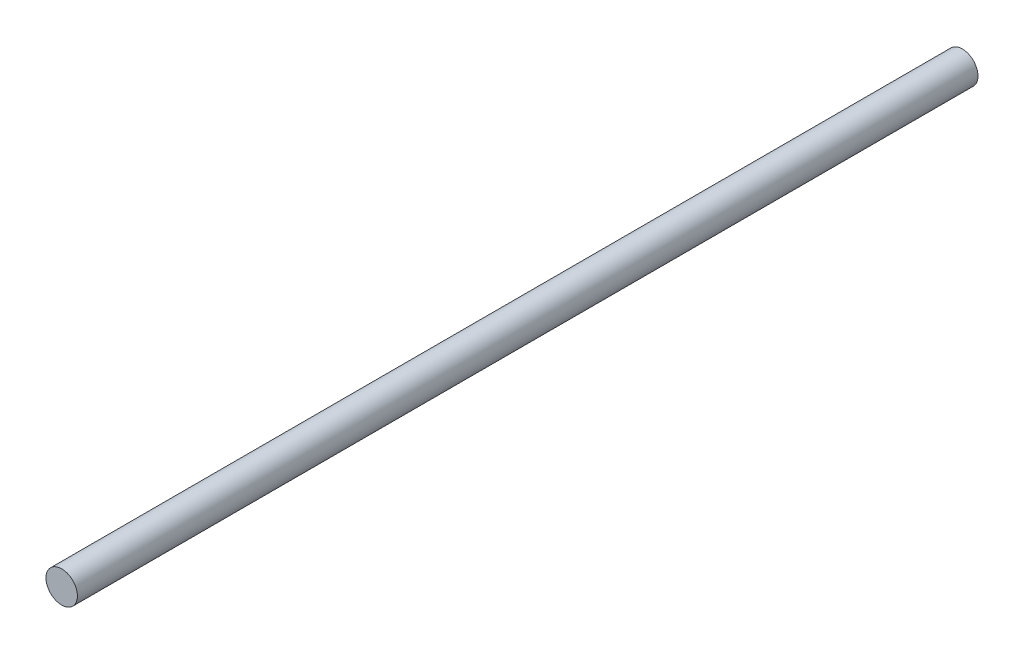
ISO-10303-21;
HEADER;
FILE_DESCRIPTION(('STEP AP214'),'2;1');
FILE_NAME('part.step','',(''),(''),'','','');
FILE_SCHEMA(('AUTOMOTIVE_DESIGN { 1 0 10303 214 1 1 1 1 }'));
ENDSEC;
DATA;
#1=APPLICATION_CONTEXT('core data for automotive mechanical design processes');
#2=APPLICATION_PROTOCOL_DEFINITION('international standard','automotive_design',2000,#1);
#3=PRODUCT_CONTEXT('',#1,'mechanical');
#4=PRODUCT('Part','Part','',(#3));
#5=PRODUCT_RELATED_PRODUCT_CATEGORY('part','',(#4));
#6=PRODUCT_DEFINITION_FORMATION('','',#4);
#7=PRODUCT_DEFINITION_CONTEXT('part definition',#1,'design');
#8=PRODUCT_DEFINITION('design','',#6,#7);
#9=PRODUCT_DEFINITION_SHAPE('','',#8);
#10=(LENGTH_UNIT() NAMED_UNIT(*) SI_UNIT(.MILLI.,.METRE.));
#11=(NAMED_UNIT(*) PLANE_ANGLE_UNIT() SI_UNIT($,.RADIAN.));
#12=(NAMED_UNIT(*) SI_UNIT($,.STERADIAN.) SOLID_ANGLE_UNIT());
#13=UNCERTAINTY_MEASURE_WITH_UNIT(LENGTH_MEASURE(1.E-05),#10,'distance_accuracy_value','');
#14=(GEOMETRIC_REPRESENTATION_CONTEXT(3) GLOBAL_UNCERTAINTY_ASSIGNED_CONTEXT((#13)) GLOBAL_UNIT_ASSIGNED_CONTEXT((#10,
#11,#12)) REPRESENTATION_CONTEXT('',''));
#15=CARTESIAN_POINT('',(0.,0.,0.));
#16=DIRECTION('',(0.,0.,1.));
#17=DIRECTION('',(1.,0.,0.));
#18=AXIS2_PLACEMENT_3D('',#15,#16,#17);
#19=CARTESIAN_POINT('',(0.,0.,228.6));
#20=DIRECTION('',(0.,0.,-1.));
#21=DIRECTION('',(-1.,0.,0.));
#22=AXIS2_PLACEMENT_3D('',#19,#20,#21);
#23=CYLINDRICAL_SURFACE('',#22,3.9878);
#24=CARTESIAN_POINT('',(0.,0.,228.6));
#25=DIRECTION('',(0.,0.,1.));
#26=DIRECTION('',(1.,0.,0.));
#27=AXIS2_PLACEMENT_3D('',#24,#25,#26);
#28=CIRCLE('',#27,3.9878);
#29=CARTESIAN_POINT('',(3.9878,0.,228.6));
#30=VERTEX_POINT('',#29);
#31=EDGE_CURVE('E10',#30,#30,#28,.T.);
#32=ORIENTED_EDGE('',*,*,#31,.F.);
#33=EDGE_LOOP('',(#32));
#34=FACE_BOUND('',#33,.T.);
#35=CARTESIAN_POINT('',(0.,0.,0.));
#36=DIRECTION('',(0.,0.,1.));
#37=DIRECTION('',(1.,0.,0.));
#38=AXIS2_PLACEMENT_3D('',#35,#36,#37);
#39=CIRCLE('',#38,3.9878);
#40=CARTESIAN_POINT('',(3.9878,0.,0.));
#41=VERTEX_POINT('',#40);
#42=EDGE_CURVE('E37',#41,#41,#39,.T.);
#43=ORIENTED_EDGE('',*,*,#42,.T.);
#44=EDGE_LOOP('',(#43));
#45=FACE_BOUND('',#44,.T.);
#46=ADVANCED_FACE('F34',(#34,#45),#23,.T.);
#47=CARTESIAN_POINT('',(0.,0.,228.6));
#48=DIRECTION('',(0.,0.,1.));
#49=DIRECTION('',(1.,0.,0.));
#50=AXIS2_PLACEMENT_3D('',#47,#48,#49);
#51=PLANE('',#50);
#52=ORIENTED_EDGE('',*,*,#31,.T.);
#53=EDGE_LOOP('',(#52));
#54=FACE_BOUND('',#53,.T.);
#55=ADVANCED_FACE('F49',(#54),#51,.T.);
#56=CARTESIAN_POINT('',(0.,0.,0.));
#57=DIRECTION('',(0.,0.,1.));
#58=DIRECTION('',(1.,0.,0.));
#59=AXIS2_PLACEMENT_3D('',#56,#57,#58);
#60=PLANE('',#59);
#61=ORIENTED_EDGE('',*,*,#42,.F.);
#62=EDGE_LOOP('',(#61));
#63=FACE_BOUND('',#62,.T.);
#64=ADVANCED_FACE('F47',(#63),#60,.F.);
#65=CLOSED_SHELL('',(#46,#55,#64));
#66=MANIFOLD_SOLID_BREP('B2',#65);
#67=ADVANCED_BREP_SHAPE_REPRESENTATION('',(#18,#66),#14);
#68=SHAPE_DEFINITION_REPRESENTATION(#9,#67);
ENDSEC;
END-ISO-10303-21;
